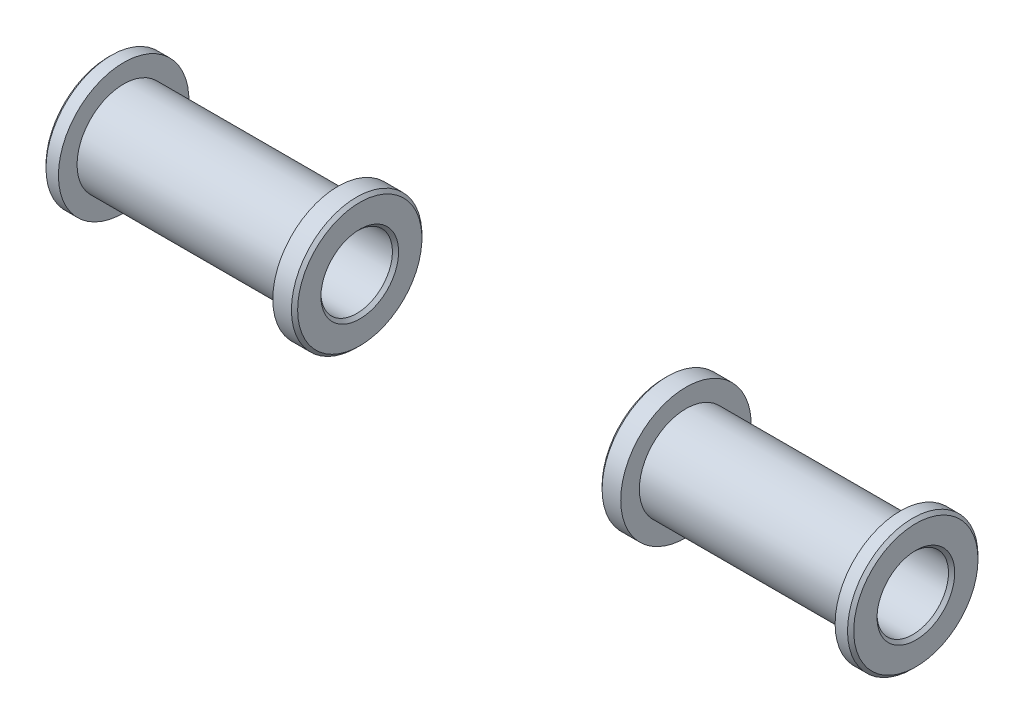
ISO-10303-21;
HEADER;
FILE_DESCRIPTION(('STEP AP214'),'2;1');
FILE_NAME('part.step','',(''),(''),'','','');
FILE_SCHEMA(('AUTOMOTIVE_DESIGN { 1 0 10303 214 1 1 1 1 }'));
ENDSEC;
DATA;
#1=APPLICATION_CONTEXT('core data for automotive mechanical design processes');
#2=APPLICATION_PROTOCOL_DEFINITION('international standard','automotive_design',2000,#1);
#3=PRODUCT_CONTEXT('',#1,'mechanical');
#4=PRODUCT('Part','Part','',(#3));
#5=PRODUCT_RELATED_PRODUCT_CATEGORY('part','',(#4));
#6=PRODUCT_DEFINITION_FORMATION('','',#4);
#7=PRODUCT_DEFINITION_CONTEXT('part definition',#1,'design');
#8=PRODUCT_DEFINITION('design','',#6,#7);
#9=PRODUCT_DEFINITION_SHAPE('','',#8);
#10=(LENGTH_UNIT() NAMED_UNIT(*) SI_UNIT(.MILLI.,.METRE.));
#11=(NAMED_UNIT(*) PLANE_ANGLE_UNIT() SI_UNIT($,.RADIAN.));
#12=(NAMED_UNIT(*) SI_UNIT($,.STERADIAN.) SOLID_ANGLE_UNIT());
#13=UNCERTAINTY_MEASURE_WITH_UNIT(LENGTH_MEASURE(1.E-05),#10,'distance_accuracy_value','');
#14=(GEOMETRIC_REPRESENTATION_CONTEXT(3) GLOBAL_UNCERTAINTY_ASSIGNED_CONTEXT((#13)) GLOBAL_UNIT_ASSIGNED_CONTEXT((#10,
#11,#12)) REPRESENTATION_CONTEXT('',''));
#15=CARTESIAN_POINT('',(0.,0.,0.));
#16=DIRECTION('',(0.,0.,1.));
#17=DIRECTION('',(1.,0.,0.));
#18=AXIS2_PLACEMENT_3D('',#15,#16,#17);
#19=CARTESIAN_POINT('',(0.,0.,0.));
#20=DIRECTION('',(1.,0.,0.));
#21=DIRECTION('',(0.,0.,1.));
#22=AXIS2_PLACEMENT_3D('',#19,#20,#21);
#23=CYLINDRICAL_SURFACE('',#22,21.);
#24=CARTESIAN_POINT('',(-50.,0.,0.));
#25=DIRECTION('',(-1.,0.,0.));
#26=DIRECTION('',(0.,0.,1.));
#27=AXIS2_PLACEMENT_3D('',#24,#25,#26);
#28=CIRCLE('',#27,21.);
#29=CARTESIAN_POINT('',(-50.,0.,21.));
#30=VERTEX_POINT('',#29);
#31=EDGE_CURVE('E56',#30,#30,#28,.F.);
#32=ORIENTED_EDGE('',*,*,#31,.F.);
#33=EDGE_LOOP('',(#32));
#34=FACE_BOUND('',#33,.T.);
#35=CARTESIAN_POINT('',(-56.,0.,0.));
#36=DIRECTION('',(-1.,0.,0.));
#37=DIRECTION('',(0.,0.,1.));
#38=AXIS2_PLACEMENT_3D('',#35,#36,#37);
#39=CIRCLE('',#38,21.);
#40=CARTESIAN_POINT('',(-56.,0.,21.));
#41=VERTEX_POINT('',#40);
#42=EDGE_CURVE('E100',#41,#41,#39,.T.);
#43=ORIENTED_EDGE('',*,*,#42,.F.);
#44=EDGE_LOOP('',(#43));
#45=FACE_BOUND('',#44,.T.);
#46=ADVANCED_FACE('F48',(#34,#45),#23,.T.);
#47=CARTESIAN_POINT('',(-49.,0.,21.));
#48=DIRECTION('',(1.,0.,0.));
#49=DIRECTION('',(0.,0.,1.));
#50=AXIS2_PLACEMENT_3D('',#47,#48,#49);
#51=PLANE('',#50);
#52=CARTESIAN_POINT('',(-49.,0.,0.));
#53=DIRECTION('',(-1.,0.,0.));
#54=DIRECTION('',(0.,0.,1.));
#55=AXIS2_PLACEMENT_3D('',#52,#53,#54);
#56=CIRCLE('',#55,12.5);
#57=CARTESIAN_POINT('',(-49.,0.,12.5));
#58=VERTEX_POINT('',#57);
#59=EDGE_CURVE('E72',#58,#58,#56,.F.);
#60=ORIENTED_EDGE('',*,*,#59,.F.);
#61=EDGE_LOOP('',(#60));
#62=FACE_BOUND('',#61,.T.);
#63=CARTESIAN_POINT('',(-49.,0.,0.));
#64=DIRECTION('',(-1.,0.,0.));
#65=DIRECTION('',(0.,0.,1.));
#66=AXIS2_PLACEMENT_3D('',#63,#64,#65);
#67=CIRCLE('',#66,20.);
#68=CARTESIAN_POINT('',(-49.,0.,20.));
#69=VERTEX_POINT('',#68);
#70=EDGE_CURVE('E76',#69,#69,#67,.T.);
#71=ORIENTED_EDGE('',*,*,#70,.F.);
#72=EDGE_LOOP('',(#71));
#73=FACE_BOUND('',#72,.T.);
#74=ADVANCED_FACE('F108',(#62,#73),#51,.T.);
#75=CARTESIAN_POINT('',(0.,0.,0.));
#76=DIRECTION('',(1.,0.,0.));
#77=DIRECTION('',(0.,0.,1.));
#78=AXIS2_PLACEMENT_3D('',#75,#76,#77);
#79=CYLINDRICAL_SURFACE('',#78,11.5);
#80=CARTESIAN_POINT('',(-50.,0.,0.));
#81=DIRECTION('',(-1.,0.,0.));
#82=DIRECTION('',(0.,0.,1.));
#83=AXIS2_PLACEMENT_3D('',#80,#81,#82);
#84=CIRCLE('',#83,11.5);
#85=CARTESIAN_POINT('',(-50.,0.,11.5));
#86=VERTEX_POINT('',#85);
#87=EDGE_CURVE('E80',#86,#86,#84,.T.);
#88=ORIENTED_EDGE('',*,*,#87,.F.);
#89=EDGE_LOOP('',(#88));
#90=FACE_BOUND('',#89,.T.);
#91=CARTESIAN_POINT('',(-129.,0.,0.));
#92=DIRECTION('',(1.,0.,0.));
#93=DIRECTION('',(0.,0.,-1.));
#94=AXIS2_PLACEMENT_3D('',#91,#92,#93);
#95=CIRCLE('',#94,11.5);
#96=CARTESIAN_POINT('',(-129.,0.,-11.5));
#97=VERTEX_POINT('',#96);
#98=EDGE_CURVE('E84',#97,#97,#95,.T.);
#99=ORIENTED_EDGE('',*,*,#98,.F.);
#100=EDGE_LOOP('',(#99));
#101=FACE_BOUND('',#100,.T.);
#102=ADVANCED_FACE('F114',(#90,#101),#79,.F.);
#103=CARTESIAN_POINT('',(-130.,0.,11.5));
#104=DIRECTION('',(-1.,0.,0.));
#105=DIRECTION('',(0.,0.,-1.));
#106=AXIS2_PLACEMENT_3D('',#103,#104,#105);
#107=PLANE('',#106);
#108=CARTESIAN_POINT('',(-130.,0.,0.));
#109=DIRECTION('',(1.,0.,0.));
#110=DIRECTION('',(0.,0.,-1.));
#111=AXIS2_PLACEMENT_3D('',#108,#109,#110);
#112=CIRCLE('',#111,12.5);
#113=CARTESIAN_POINT('',(-130.,0.,-12.5));
#114=VERTEX_POINT('',#113);
#115=EDGE_CURVE('E61',#114,#114,#112,.F.);
#116=ORIENTED_EDGE('',*,*,#115,.F.);
#117=EDGE_LOOP('',(#116));
#118=FACE_BOUND('',#117,.T.);
#119=CARTESIAN_POINT('',(-130.,0.,0.));
#120=DIRECTION('',(1.,0.,0.));
#121=DIRECTION('',(0.,0.,-1.));
#122=AXIS2_PLACEMENT_3D('',#119,#120,#121);
#123=CIRCLE('',#122,20.);
#124=CARTESIAN_POINT('',(-130.,0.,-20.));
#125=VERTEX_POINT('',#124);
#126=EDGE_CURVE('E66',#125,#125,#123,.T.);
#127=ORIENTED_EDGE('',*,*,#126,.F.);
#128=EDGE_LOOP('',(#127));
#129=FACE_BOUND('',#128,.T.);
#130=ADVANCED_FACE('F139',(#118,#129),#107,.T.);
#131=CARTESIAN_POINT('',(0.,0.,0.));
#132=DIRECTION('',(1.,0.,0.));
#133=DIRECTION('',(0.,0.,1.));
#134=AXIS2_PLACEMENT_3D('',#131,#132,#133);
#135=CYLINDRICAL_SURFACE('',#134,21.);
#136=CARTESIAN_POINT('',(-129.,0.,0.));
#137=DIRECTION('',(1.,0.,0.));
#138=DIRECTION('',(0.,0.,-1.));
#139=AXIS2_PLACEMENT_3D('',#136,#137,#138);
#140=CIRCLE('',#139,21.);
#141=CARTESIAN_POINT('',(-129.,0.,-21.));
#142=VERTEX_POINT('',#141);
#143=EDGE_CURVE('E11',#142,#142,#140,.F.);
#144=ORIENTED_EDGE('',*,*,#143,.F.);
#145=EDGE_LOOP('',(#144));
#146=FACE_BOUND('',#145,.T.);
#147=CARTESIAN_POINT('',(-125.,0.,0.));
#148=DIRECTION('',(-1.,0.,0.));
#149=DIRECTION('',(0.,0.,1.));
#150=AXIS2_PLACEMENT_3D('',#147,#148,#149);
#151=CIRCLE('',#150,21.);
#152=CARTESIAN_POINT('',(-125.,0.,21.));
#153=VERTEX_POINT('',#152);
#154=EDGE_CURVE('E88',#153,#153,#151,.T.);
#155=ORIENTED_EDGE('',*,*,#154,.T.);
#156=EDGE_LOOP('',(#155));
#157=FACE_BOUND('',#156,.T.);
#158=ADVANCED_FACE('F141',(#146,#157),#135,.T.);
#159=CARTESIAN_POINT('',(-125.,0.,21.));
#160=DIRECTION('',(1.,0.,0.));
#161=DIRECTION('',(0.,0.,1.));
#162=AXIS2_PLACEMENT_3D('',#159,#160,#161);
#163=PLANE('',#162);
#164=ORIENTED_EDGE('',*,*,#154,.F.);
#165=EDGE_LOOP('',(#164));
#166=FACE_BOUND('',#165,.T.);
#167=CARTESIAN_POINT('',(-125.,0.,0.));
#168=DIRECTION('',(-1.,0.,0.));
#169=DIRECTION('',(0.,0.,1.));
#170=AXIS2_PLACEMENT_3D('',#167,#168,#169);
#171=CIRCLE('',#170,15.);
#172=CARTESIAN_POINT('',(-125.,0.,15.));
#173=VERTEX_POINT('',#172);
#174=EDGE_CURVE('E92',#173,#173,#171,.T.);
#175=ORIENTED_EDGE('',*,*,#174,.T.);
#176=EDGE_LOOP('',(#175));
#177=FACE_BOUND('',#176,.T.);
#178=ADVANCED_FACE('F148',(#166,#177),#163,.T.);
#179=CARTESIAN_POINT('',(0.,0.,0.));
#180=DIRECTION('',(1.,0.,0.));
#181=DIRECTION('',(0.,0.,1.));
#182=AXIS2_PLACEMENT_3D('',#179,#180,#181);
#183=CYLINDRICAL_SURFACE('',#182,15.);
#184=ORIENTED_EDGE('',*,*,#174,.F.);
#185=EDGE_LOOP('',(#184));
#186=FACE_BOUND('',#185,.T.);
#187=CARTESIAN_POINT('',(-56.,0.,0.));
#188=DIRECTION('',(-1.,0.,0.));
#189=DIRECTION('',(0.,0.,1.));
#190=AXIS2_PLACEMENT_3D('',#187,#188,#189);
#191=CIRCLE('',#190,15.);
#192=CARTESIAN_POINT('',(-56.,0.,15.));
#193=VERTEX_POINT('',#192);
#194=EDGE_CURVE('E96',#193,#193,#191,.T.);
#195=ORIENTED_EDGE('',*,*,#194,.T.);
#196=EDGE_LOOP('',(#195));
#197=FACE_BOUND('',#196,.T.);
#198=ADVANCED_FACE('F156',(#186,#197),#183,.T.);
#199=CARTESIAN_POINT('',(-56.,0.,15.));
#200=DIRECTION('',(-1.,0.,0.));
#201=DIRECTION('',(0.,0.,-1.));
#202=AXIS2_PLACEMENT_3D('',#199,#200,#201);
#203=PLANE('',#202);
#204=ORIENTED_EDGE('',*,*,#194,.F.);
#205=EDGE_LOOP('',(#204));
#206=FACE_BOUND('',#205,.T.);
#207=ORIENTED_EDGE('',*,*,#42,.T.);
#208=EDGE_LOOP('',(#207));
#209=FACE_BOUND('',#208,.T.);
#210=ADVANCED_FACE('F105',(#206,#209),#203,.T.);
#211=CARTESIAN_POINT('',(-50.,0.,0.));
#212=DIRECTION('',(1.,0.,0.));
#213=DIRECTION('',(0.,0.,1.));
#214=AXIS2_PLACEMENT_3D('',#211,#212,#213);
#215=CONICAL_SURFACE('',#214,11.5,0.78539816339745);
#216=ORIENTED_EDGE('',*,*,#59,.T.);
#217=EDGE_LOOP('',(#216));
#218=FACE_BOUND('',#217,.T.);
#219=ORIENTED_EDGE('',*,*,#87,.T.);
#220=EDGE_LOOP('',(#219));
#221=FACE_BOUND('',#220,.T.);
#222=ADVANCED_FACE('F119',(#218,#221),#215,.F.);
#223=CARTESIAN_POINT('',(-130.,0.,0.));
#224=DIRECTION('',(-1.,0.,0.));
#225=DIRECTION('',(0.,0.,-1.));
#226=AXIS2_PLACEMENT_3D('',#223,#224,#225);
#227=CONICAL_SURFACE('',#226,12.5,0.785398163397454);
#228=ORIENTED_EDGE('',*,*,#98,.T.);
#229=EDGE_LOOP('',(#228));
#230=FACE_BOUND('',#229,.T.);
#231=ORIENTED_EDGE('',*,*,#115,.T.);
#232=EDGE_LOOP('',(#231));
#233=FACE_BOUND('',#232,.T.);
#234=ADVANCED_FACE('F122',(#230,#233),#227,.F.);
#235=CARTESIAN_POINT('',(-49.,0.,0.));
#236=DIRECTION('',(-1.,0.,0.));
#237=DIRECTION('',(0.,0.,-1.));
#238=AXIS2_PLACEMENT_3D('',#235,#236,#237);
#239=CONICAL_SURFACE('',#238,20.,0.785398163397447);
#240=ORIENTED_EDGE('',*,*,#31,.T.);
#241=EDGE_LOOP('',(#240));
#242=FACE_BOUND('',#241,.T.);
#243=ORIENTED_EDGE('',*,*,#70,.T.);
#244=EDGE_LOOP('',(#243));
#245=FACE_BOUND('',#244,.T.);
#246=ADVANCED_FACE('F125',(#242,#245),#239,.T.);
#247=CARTESIAN_POINT('',(-129.,0.,0.));
#248=DIRECTION('',(1.,0.,0.));
#249=DIRECTION('',(0.,0.,1.));
#250=AXIS2_PLACEMENT_3D('',#247,#248,#249);
#251=CONICAL_SURFACE('',#250,21.,0.785398163397452);
#252=ORIENTED_EDGE('',*,*,#126,.T.);
#253=EDGE_LOOP('',(#252));
#254=FACE_BOUND('',#253,.T.);
#255=ORIENTED_EDGE('',*,*,#143,.T.);
#256=EDGE_LOOP('',(#255));
#257=FACE_BOUND('',#256,.T.);
#258=ADVANCED_FACE('F50',(#254,#257),#251,.T.);
#259=CLOSED_SHELL('',(#46,#74,#102,#130,#158,#178,#198,#210,#222,#234,#246,#258));
#260=MANIFOLD_SOLID_BREP('B2',#259);
#261=CARTESIAN_POINT('',(0.,0.,0.));
#262=DIRECTION('',(-1.,0.,0.));
#263=DIRECTION('',(0.,0.,1.));
#264=AXIS2_PLACEMENT_3D('',#261,#262,#263);
#265=CYLINDRICAL_SURFACE('',#264,21.);
#266=CARTESIAN_POINT('',(50.,0.,0.));
#267=DIRECTION('',(-1.,0.,0.));
#268=DIRECTION('',(0.,0.,1.));
#269=AXIS2_PLACEMENT_3D('',#266,#267,#268);
#270=CIRCLE('',#269,21.);
#271=CARTESIAN_POINT('',(50.,0.,21.));
#272=VERTEX_POINT('',#271);
#273=EDGE_CURVE('E273',#272,#272,#270,.F.);
#274=ORIENTED_EDGE('',*,*,#273,.T.);
#275=EDGE_LOOP('',(#274));
#276=FACE_BOUND('',#275,.T.);
#277=CARTESIAN_POINT('',(56.,0.,0.));
#278=DIRECTION('',(-1.,0.,0.));
#279=DIRECTION('',(0.,0.,1.));
#280=AXIS2_PLACEMENT_3D('',#277,#278,#279);
#281=CIRCLE('',#280,21.);
#282=CARTESIAN_POINT('',(56.,0.,21.));
#283=VERTEX_POINT('',#282);
#284=EDGE_CURVE('E307',#283,#283,#281,.T.);
#285=ORIENTED_EDGE('',*,*,#284,.T.);
#286=EDGE_LOOP('',(#285));
#287=FACE_BOUND('',#286,.T.);
#288=ADVANCED_FACE('F265',(#276,#287),#265,.T.);
#289=CARTESIAN_POINT('',(49.,0.,21.));
#290=DIRECTION('',(-1.,0.,0.));
#291=DIRECTION('',(0.,0.,1.));
#292=AXIS2_PLACEMENT_3D('',#289,#290,#291);
#293=PLANE('',#292);
#294=CARTESIAN_POINT('',(49.,0.,0.));
#295=DIRECTION('',(-1.,0.,0.));
#296=DIRECTION('',(0.,0.,1.));
#297=AXIS2_PLACEMENT_3D('',#294,#295,#296);
#298=CIRCLE('',#297,12.5);
#299=CARTESIAN_POINT('',(49.,0.,12.5));
#300=VERTEX_POINT('',#299);
#301=EDGE_CURVE('E286',#300,#300,#298,.F.);
#302=ORIENTED_EDGE('',*,*,#301,.T.);
#303=EDGE_LOOP('',(#302));
#304=FACE_BOUND('',#303,.T.);
#305=CARTESIAN_POINT('',(49.,0.,0.));
#306=DIRECTION('',(-1.,0.,0.));
#307=DIRECTION('',(0.,0.,1.));
#308=AXIS2_PLACEMENT_3D('',#305,#306,#307);
#309=CIRCLE('',#308,20.);
#310=CARTESIAN_POINT('',(49.,0.,20.));
#311=VERTEX_POINT('',#310);
#312=EDGE_CURVE('E289',#311,#311,#309,.T.);
#313=ORIENTED_EDGE('',*,*,#312,.T.);
#314=EDGE_LOOP('',(#313));
#315=FACE_BOUND('',#314,.T.);
#316=ADVANCED_FACE('F329',(#304,#315),#293,.T.);
#317=CARTESIAN_POINT('',(0.,0.,0.));
#318=DIRECTION('',(-1.,0.,0.));
#319=DIRECTION('',(0.,0.,1.));
#320=AXIS2_PLACEMENT_3D('',#317,#318,#319);
#321=CYLINDRICAL_SURFACE('',#320,11.5);
#322=CARTESIAN_POINT('',(50.,0.,0.));
#323=DIRECTION('',(-1.,0.,0.));
#324=DIRECTION('',(0.,0.,1.));
#325=AXIS2_PLACEMENT_3D('',#322,#323,#324);
#326=CIRCLE('',#325,11.5);
#327=CARTESIAN_POINT('',(50.,0.,11.5));
#328=VERTEX_POINT('',#327);
#329=EDGE_CURVE('E292',#328,#328,#326,.T.);
#330=ORIENTED_EDGE('',*,*,#329,.T.);
#331=EDGE_LOOP('',(#330));
#332=FACE_BOUND('',#331,.T.);
#333=CARTESIAN_POINT('',(129.,0.,0.));
#334=DIRECTION('',(1.,0.,0.));
#335=DIRECTION('',(0.,0.,-1.));
#336=AXIS2_PLACEMENT_3D('',#333,#334,#335);
#337=CIRCLE('',#336,11.5);
#338=CARTESIAN_POINT('',(129.,0.,-11.5));
#339=VERTEX_POINT('',#338);
#340=EDGE_CURVE('E295',#339,#339,#337,.T.);
#341=ORIENTED_EDGE('',*,*,#340,.T.);
#342=EDGE_LOOP('',(#341));
#343=FACE_BOUND('',#342,.T.);
#344=ADVANCED_FACE('F334',(#332,#343),#321,.F.);
#345=CARTESIAN_POINT('',(130.,0.,11.5));
#346=DIRECTION('',(1.,0.,0.));
#347=DIRECTION('',(0.,0.,-1.));
#348=AXIS2_PLACEMENT_3D('',#345,#346,#347);
#349=PLANE('',#348);
#350=CARTESIAN_POINT('',(130.,0.,0.));
#351=DIRECTION('',(1.,0.,0.));
#352=DIRECTION('',(0.,0.,-1.));
#353=AXIS2_PLACEMENT_3D('',#350,#351,#352);
#354=CIRCLE('',#353,12.5);
#355=CARTESIAN_POINT('',(130.,0.,-12.5));
#356=VERTEX_POINT('',#355);
#357=EDGE_CURVE('E277',#356,#356,#354,.F.);
#358=ORIENTED_EDGE('',*,*,#357,.T.);
#359=EDGE_LOOP('',(#358));
#360=FACE_BOUND('',#359,.T.);
#361=CARTESIAN_POINT('',(130.,0.,0.));
#362=DIRECTION('',(1.,0.,0.));
#363=DIRECTION('',(0.,0.,-1.));
#364=AXIS2_PLACEMENT_3D('',#361,#362,#363);
#365=CIRCLE('',#364,20.);
#366=CARTESIAN_POINT('',(130.,0.,-20.));
#367=VERTEX_POINT('',#366);
#368=EDGE_CURVE('E281',#367,#367,#365,.T.);
#369=ORIENTED_EDGE('',*,*,#368,.T.);
#370=EDGE_LOOP('',(#369));
#371=FACE_BOUND('',#370,.T.);
#372=ADVANCED_FACE('F365',(#360,#371),#349,.T.);
#373=CARTESIAN_POINT('',(0.,0.,0.));
#374=DIRECTION('',(-1.,0.,0.));
#375=DIRECTION('',(0.,0.,1.));
#376=AXIS2_PLACEMENT_3D('',#373,#374,#375);
#377=CYLINDRICAL_SURFACE('',#376,21.);
#378=CARTESIAN_POINT('',(129.,0.,0.));
#379=DIRECTION('',(1.,0.,0.));
#380=DIRECTION('',(0.,0.,-1.));
#381=AXIS2_PLACEMENT_3D('',#378,#379,#380);
#382=CIRCLE('',#381,21.);
#383=CARTESIAN_POINT('',(129.,0.,-21.));
#384=VERTEX_POINT('',#383);
#385=EDGE_CURVE('E47',#384,#384,#382,.F.);
#386=ORIENTED_EDGE('',*,*,#385,.T.);
#387=EDGE_LOOP('',(#386));
#388=FACE_BOUND('',#387,.T.);
#389=CARTESIAN_POINT('',(125.,0.,0.));
#390=DIRECTION('',(-1.,0.,0.));
#391=DIRECTION('',(0.,0.,1.));
#392=AXIS2_PLACEMENT_3D('',#389,#390,#391);
#393=CIRCLE('',#392,21.);
#394=CARTESIAN_POINT('',(125.,0.,21.));
#395=VERTEX_POINT('',#394);
#396=EDGE_CURVE('E298',#395,#395,#393,.T.);
#397=ORIENTED_EDGE('',*,*,#396,.F.);
#398=EDGE_LOOP('',(#397));
#399=FACE_BOUND('',#398,.T.);
#400=ADVANCED_FACE('F367',(#388,#399),#377,.T.);
#401=CARTESIAN_POINT('',(125.,0.,21.));
#402=DIRECTION('',(-1.,0.,0.));
#403=DIRECTION('',(0.,0.,1.));
#404=AXIS2_PLACEMENT_3D('',#401,#402,#403);
#405=PLANE('',#404);
#406=ORIENTED_EDGE('',*,*,#396,.T.);
#407=EDGE_LOOP('',(#406));
#408=FACE_BOUND('',#407,.T.);
#409=CARTESIAN_POINT('',(125.,0.,0.));
#410=DIRECTION('',(-1.,0.,0.));
#411=DIRECTION('',(0.,0.,1.));
#412=AXIS2_PLACEMENT_3D('',#409,#410,#411);
#413=CIRCLE('',#412,15.);
#414=CARTESIAN_POINT('',(125.,0.,15.));
#415=VERTEX_POINT('',#414);
#416=EDGE_CURVE('E301',#415,#415,#413,.T.);
#417=ORIENTED_EDGE('',*,*,#416,.F.);
#418=EDGE_LOOP('',(#417));
#419=FACE_BOUND('',#418,.T.);
#420=ADVANCED_FACE('F325',(#408,#419),#405,.T.);
#421=CARTESIAN_POINT('',(0.,0.,0.));
#422=DIRECTION('',(-1.,0.,0.));
#423=DIRECTION('',(0.,0.,1.));
#424=AXIS2_PLACEMENT_3D('',#421,#422,#423);
#425=CYLINDRICAL_SURFACE('',#424,15.);
#426=ORIENTED_EDGE('',*,*,#416,.T.);
#427=EDGE_LOOP('',(#426));
#428=FACE_BOUND('',#427,.T.);
#429=CARTESIAN_POINT('',(56.,0.,0.));
#430=DIRECTION('',(-1.,0.,0.));
#431=DIRECTION('',(0.,0.,1.));
#432=AXIS2_PLACEMENT_3D('',#429,#430,#431);
#433=CIRCLE('',#432,15.);
#434=CARTESIAN_POINT('',(56.,0.,15.));
#435=VERTEX_POINT('',#434);
#436=EDGE_CURVE('E304',#435,#435,#433,.T.);
#437=ORIENTED_EDGE('',*,*,#436,.F.);
#438=EDGE_LOOP('',(#437));
#439=FACE_BOUND('',#438,.T.);
#440=ADVANCED_FACE('F315',(#428,#439),#425,.T.);
#441=CARTESIAN_POINT('',(56.,0.,15.));
#442=DIRECTION('',(1.,0.,0.));
#443=DIRECTION('',(0.,0.,-1.));
#444=AXIS2_PLACEMENT_3D('',#441,#442,#443);
#445=PLANE('',#444);
#446=ORIENTED_EDGE('',*,*,#436,.T.);
#447=EDGE_LOOP('',(#446));
#448=FACE_BOUND('',#447,.T.);
#449=ORIENTED_EDGE('',*,*,#284,.F.);
#450=EDGE_LOOP('',(#449));
#451=FACE_BOUND('',#450,.T.);
#452=ADVANCED_FACE('F312',(#448,#451),#445,.T.);
#453=CARTESIAN_POINT('',(50.,0.,0.));
#454=DIRECTION('',(-1.,0.,0.));
#455=DIRECTION('',(0.,0.,1.));
#456=AXIS2_PLACEMENT_3D('',#453,#454,#455);
#457=CONICAL_SURFACE('',#456,11.5,0.78539816339745);
#458=ORIENTED_EDGE('',*,*,#301,.F.);
#459=EDGE_LOOP('',(#458));
#460=FACE_BOUND('',#459,.T.);
#461=ORIENTED_EDGE('',*,*,#329,.F.);
#462=EDGE_LOOP('',(#461));
#463=FACE_BOUND('',#462,.T.);
#464=ADVANCED_FACE('F314',(#460,#463),#457,.F.);
#465=CARTESIAN_POINT('',(130.,0.,0.));
#466=DIRECTION('',(1.,0.,0.));
#467=DIRECTION('',(0.,0.,-1.));
#468=AXIS2_PLACEMENT_3D('',#465,#466,#467);
#469=CONICAL_SURFACE('',#468,12.5,0.785398163397454);
#470=ORIENTED_EDGE('',*,*,#340,.F.);
#471=EDGE_LOOP('',(#470));
#472=FACE_BOUND('',#471,.T.);
#473=ORIENTED_EDGE('',*,*,#357,.F.);
#474=EDGE_LOOP('',(#473));
#475=FACE_BOUND('',#474,.T.);
#476=ADVANCED_FACE('F322',(#472,#475),#469,.F.);
#477=CARTESIAN_POINT('',(49.,0.,0.));
#478=DIRECTION('',(1.,0.,0.));
#479=DIRECTION('',(0.,0.,-1.));
#480=AXIS2_PLACEMENT_3D('',#477,#478,#479);
#481=CONICAL_SURFACE('',#480,20.,0.785398163397447);
#482=ORIENTED_EDGE('',*,*,#273,.F.);
#483=EDGE_LOOP('',(#482));
#484=FACE_BOUND('',#483,.T.);
#485=ORIENTED_EDGE('',*,*,#312,.F.);
#486=EDGE_LOOP('',(#485));
#487=FACE_BOUND('',#486,.T.);
#488=ADVANCED_FACE('F347',(#484,#487),#481,.T.);
#489=CARTESIAN_POINT('',(129.,0.,0.));
#490=DIRECTION('',(-1.,0.,0.));
#491=DIRECTION('',(0.,0.,1.));
#492=AXIS2_PLACEMENT_3D('',#489,#490,#491);
#493=CONICAL_SURFACE('',#492,21.,0.785398163397452);
#494=ORIENTED_EDGE('',*,*,#368,.F.);
#495=EDGE_LOOP('',(#494));
#496=FACE_BOUND('',#495,.T.);
#497=ORIENTED_EDGE('',*,*,#385,.F.);
#498=EDGE_LOOP('',(#497));
#499=FACE_BOUND('',#498,.T.);
#500=ADVANCED_FACE('F268',(#496,#499),#493,.T.);
#501=CLOSED_SHELL('',(#288,#316,#344,#372,#400,#420,#440,#452,#464,#476,#488,#500));
#502=MANIFOLD_SOLID_BREP('B6',#501);
#503=ADVANCED_BREP_SHAPE_REPRESENTATION('',(#18,#260,#502),#14);
#504=SHAPE_DEFINITION_REPRESENTATION(#9,#503);
ENDSEC;
END-ISO-10303-21;
